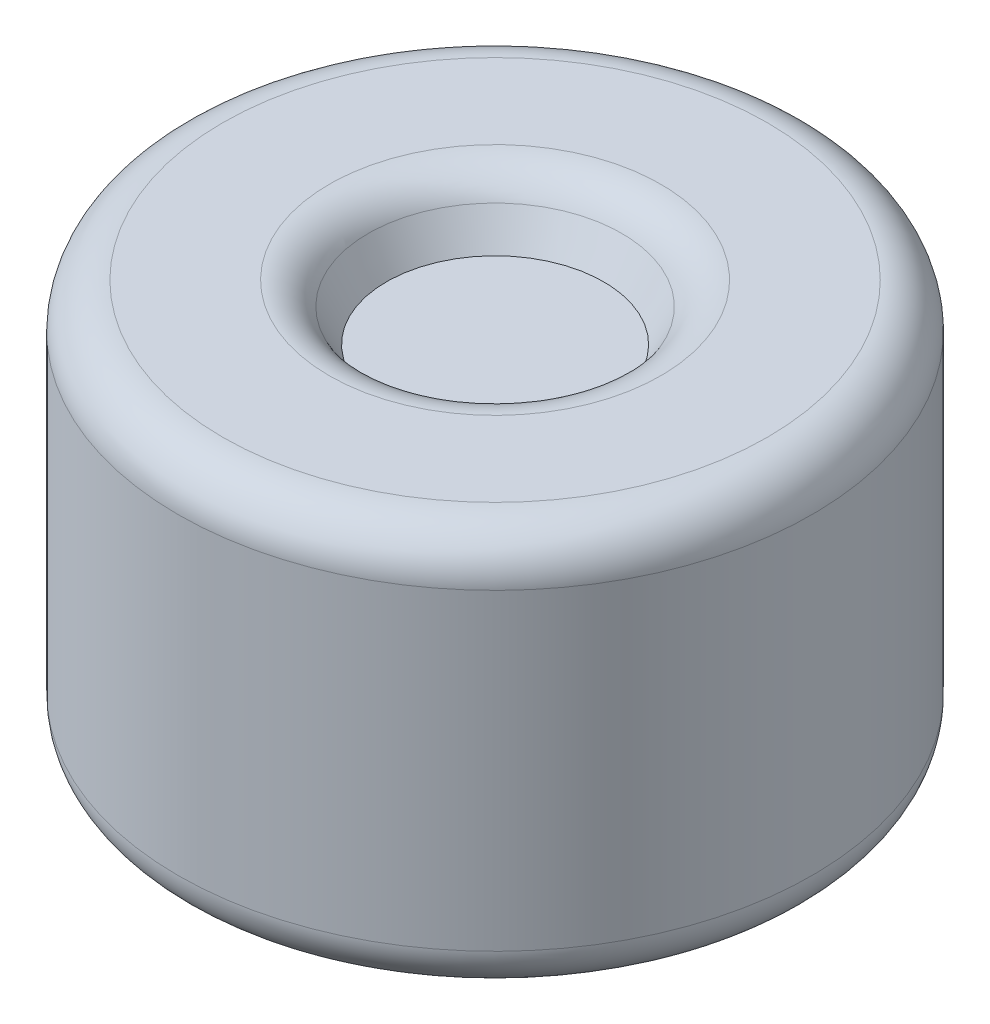
ISO-10303-21;
HEADER;
FILE_DESCRIPTION(('STEP AP214'),'2;1');
FILE_NAME('part.step','',(''),(''),'','','');
FILE_SCHEMA(('AUTOMOTIVE_DESIGN { 1 0 10303 214 1 1 1 1 }'));
ENDSEC;
DATA;
#1=APPLICATION_CONTEXT('core data for automotive mechanical design processes');
#2=APPLICATION_PROTOCOL_DEFINITION('international standard','automotive_design',2000,#1);
#3=PRODUCT_CONTEXT('',#1,'mechanical');
#4=PRODUCT('Part','Part','',(#3));
#5=PRODUCT_RELATED_PRODUCT_CATEGORY('part','',(#4));
#6=PRODUCT_DEFINITION_FORMATION('','',#4);
#7=PRODUCT_DEFINITION_CONTEXT('part definition',#1,'design');
#8=PRODUCT_DEFINITION('design','',#6,#7);
#9=PRODUCT_DEFINITION_SHAPE('','',#8);
#10=(LENGTH_UNIT() NAMED_UNIT(*) SI_UNIT(.MILLI.,.METRE.));
#11=(NAMED_UNIT(*) PLANE_ANGLE_UNIT() SI_UNIT($,.RADIAN.));
#12=(NAMED_UNIT(*) SI_UNIT($,.STERADIAN.) SOLID_ANGLE_UNIT());
#13=UNCERTAINTY_MEASURE_WITH_UNIT(LENGTH_MEASURE(1.E-05),#10,'distance_accuracy_value','');
#14=(GEOMETRIC_REPRESENTATION_CONTEXT(3) GLOBAL_UNCERTAINTY_ASSIGNED_CONTEXT((#13)) GLOBAL_UNIT_ASSIGNED_CONTEXT((#10,
#11,#12)) REPRESENTATION_CONTEXT('',''));
#15=CARTESIAN_POINT('',(0.,0.,0.));
#16=DIRECTION('',(0.,0.,1.));
#17=DIRECTION('',(1.,0.,0.));
#18=AXIS2_PLACEMENT_3D('',#15,#16,#17);
#19=CARTESIAN_POINT('',(0.,180.,0.));
#20=DIRECTION('',(0.,-1.,0.));
#21=DIRECTION('',(0.,0.,-1.));
#22=AXIS2_PLACEMENT_3D('',#19,#20,#21);
#23=CYLINDRICAL_SURFACE('',#22,284.);
#24=CARTESIAN_POINT('',(0.,-140.,0.));
#25=DIRECTION('',(0.,1.,0.));
#26=DIRECTION('',(0.,0.,1.));
#27=AXIS2_PLACEMENT_3D('',#24,#25,#26);
#28=CIRCLE('',#27,284.);
#29=CARTESIAN_POINT('',(0.,-140.,284.));
#30=VERTEX_POINT('',#29);
#31=EDGE_CURVE('E44',#30,#30,#28,.T.);
#32=ORIENTED_EDGE('',*,*,#31,.T.);
#33=EDGE_LOOP('',(#32));
#34=FACE_BOUND('',#33,.T.);
#35=CARTESIAN_POINT('',(0.,140.,0.));
#36=DIRECTION('',(0.,1.,0.));
#37=DIRECTION('',(0.,0.,1.));
#38=AXIS2_PLACEMENT_3D('',#35,#36,#37);
#39=CIRCLE('',#38,284.);
#40=CARTESIAN_POINT('',(0.,140.,284.));
#41=VERTEX_POINT('',#40);
#42=EDGE_CURVE('E57',#41,#41,#39,.F.);
#43=ORIENTED_EDGE('',*,*,#42,.T.);
#44=EDGE_LOOP('',(#43));
#45=FACE_BOUND('',#44,.T.);
#46=ADVANCED_FACE('F37',(#34,#45),#23,.T.);
#47=CARTESIAN_POINT('',(0.,180.,0.));
#48=DIRECTION('',(0.,1.,0.));
#49=DIRECTION('',(0.,0.,1.));
#50=AXIS2_PLACEMENT_3D('',#47,#48,#49);
#51=PLANE('',#50);
#52=CARTESIAN_POINT('',(0.,180.,0.));
#53=DIRECTION('',(0.,1.,0.));
#54=DIRECTION('',(0.,0.,1.));
#55=AXIS2_PLACEMENT_3D('',#52,#53,#54);
#56=CIRCLE('',#55,148.561800656822);
#57=CARTESIAN_POINT('',(0.,180.,148.561800656822));
#58=VERTEX_POINT('',#57);
#59=EDGE_CURVE('E48',#58,#58,#56,.F.);
#60=ORIENTED_EDGE('',*,*,#59,.T.);
#61=EDGE_LOOP('',(#60));
#62=FACE_BOUND('',#61,.T.);
#63=CARTESIAN_POINT('',(0.,180.,0.));
#64=DIRECTION('',(0.,1.,0.));
#65=DIRECTION('',(0.,0.,1.));
#66=AXIS2_PLACEMENT_3D('',#63,#64,#65);
#67=CIRCLE('',#66,244.);
#68=CARTESIAN_POINT('',(0.,180.,244.));
#69=VERTEX_POINT('',#68);
#70=EDGE_CURVE('E60',#69,#69,#67,.T.);
#71=ORIENTED_EDGE('',*,*,#70,.T.);
#72=EDGE_LOOP('',(#71));
#73=FACE_BOUND('',#72,.T.);
#74=ADVANCED_FACE('F80',(#62,#73),#51,.T.);
#75=CARTESIAN_POINT('',(0.,-180.,0.));
#76=DIRECTION('',(0.,1.,0.));
#77=DIRECTION('',(0.,0.,1.));
#78=AXIS2_PLACEMENT_3D('',#75,#76,#77);
#79=PLANE('',#78);
#80=CARTESIAN_POINT('',(0.,-180.,0.));
#81=DIRECTION('',(0.,1.,0.));
#82=DIRECTION('',(0.,0.,1.));
#83=AXIS2_PLACEMENT_3D('',#80,#81,#82);
#84=CIRCLE('',#83,244.);
#85=CARTESIAN_POINT('',(0.,-180.,244.));
#86=VERTEX_POINT('',#85);
#87=EDGE_CURVE('E10',#86,#86,#84,.F.);
#88=ORIENTED_EDGE('',*,*,#87,.T.);
#89=EDGE_LOOP('',(#88));
#90=FACE_BOUND('',#89,.T.);
#91=ADVANCED_FACE('F71',(#90),#79,.F.);
#92=CARTESIAN_POINT('',(0.,180.,0.));
#93=DIRECTION('',(0.,1.,0.));
#94=DIRECTION('',(0.,0.,1.));
#95=AXIS2_PLACEMENT_3D('',#92,#93,#94);
#96=CONICAL_SURFACE('',#95,125.,0.506145483078356);
#97=CARTESIAN_POINT('',(0.,159.392384809853,0.));
#98=DIRECTION('',(0.,1.,0.));
#99=DIRECTION('',(0.,0.,1.));
#100=AXIS2_PLACEMENT_3D('',#97,#98,#99);
#101=CIRCLE('',#100,113.577012371246);
#102=CARTESIAN_POINT('',(0.,159.392384809853,113.577012371246));
#103=VERTEX_POINT('',#102);
#104=EDGE_CURVE('E52',#103,#103,#101,.T.);
#105=ORIENTED_EDGE('',*,*,#104,.T.);
#106=EDGE_LOOP('',(#105));
#107=FACE_BOUND('',#106,.T.);
#108=CARTESIAN_POINT('',(0.,130.,0.));
#109=DIRECTION('',(0.,1.,0.));
#110=DIRECTION('',(0.,0.,1.));
#111=AXIS2_PLACEMENT_3D('',#108,#109,#110);
#112=CIRCLE('',#111,97.2845474273615);
#113=CARTESIAN_POINT('',(0.,130.,97.2845474273615));
#114=VERTEX_POINT('',#113);
#115=EDGE_CURVE('E63',#114,#114,#112,.T.);
#116=ORIENTED_EDGE('',*,*,#115,.F.);
#117=EDGE_LOOP('',(#116));
#118=FACE_BOUND('',#117,.T.);
#119=ADVANCED_FACE('F69',(#107,#118),#96,.F.);
#120=CARTESIAN_POINT('',(0.,130.,0.));
#121=DIRECTION('',(0.,1.,0.));
#122=DIRECTION('',(0.,0.,1.));
#123=AXIS2_PLACEMENT_3D('',#120,#121,#122);
#124=PLANE('',#123);
#125=ORIENTED_EDGE('',*,*,#115,.T.);
#126=EDGE_LOOP('',(#125));
#127=FACE_BOUND('',#126,.T.);
#128=ADVANCED_FACE('F67',(#127),#124,.T.);
#129=CARTESIAN_POINT('',(0.,140.,0.));
#130=DIRECTION('',(0.,1.,0.));
#131=DIRECTION('',(0.,0.,1.));
#132=AXIS2_PLACEMENT_3D('',#129,#130,#131);
#133=TOROIDAL_SURFACE('',#132,244.,40.);
#134=ORIENTED_EDGE('',*,*,#42,.F.);
#135=EDGE_LOOP('',(#134));
#136=FACE_BOUND('',#135,.T.);
#137=ORIENTED_EDGE('',*,*,#70,.F.);
#138=EDGE_LOOP('',(#137));
#139=FACE_BOUND('',#138,.T.);
#140=ADVANCED_FACE('F78',(#136,#139),#133,.T.);
#141=CARTESIAN_POINT('',(0.,140.,0.));
#142=DIRECTION('',(0.,1.,0.));
#143=DIRECTION('',(0.,0.,1.));
#144=AXIS2_PLACEMENT_3D('',#141,#142,#143);
#145=TOROIDAL_SURFACE('',#144,148.561800656822,40.);
#146=ORIENTED_EDGE('',*,*,#59,.F.);
#147=EDGE_LOOP('',(#146));
#148=FACE_BOUND('',#147,.T.);
#149=ORIENTED_EDGE('',*,*,#104,.F.);
#150=EDGE_LOOP('',(#149));
#151=FACE_BOUND('',#150,.T.);
#152=ADVANCED_FACE('F92',(#148,#151),#145,.T.);
#153=CARTESIAN_POINT('',(0.,-140.,0.));
#154=DIRECTION('',(0.,1.,0.));
#155=DIRECTION('',(0.,0.,1.));
#156=AXIS2_PLACEMENT_3D('',#153,#154,#155);
#157=TOROIDAL_SURFACE('',#156,244.,40.);
#158=ORIENTED_EDGE('',*,*,#87,.F.);
#159=EDGE_LOOP('',(#158));
#160=FACE_BOUND('',#159,.T.);
#161=ORIENTED_EDGE('',*,*,#31,.F.);
#162=EDGE_LOOP('',(#161));
#163=FACE_BOUND('',#162,.T.);
#164=ADVANCED_FACE('F39',(#160,#163),#157,.T.);
#165=CLOSED_SHELL('',(#46,#74,#91,#119,#128,#140,#152,#164));
#166=MANIFOLD_SOLID_BREP('B2',#165);
#167=ADVANCED_BREP_SHAPE_REPRESENTATION('',(#18,#166),#14);
#168=SHAPE_DEFINITION_REPRESENTATION(#9,#167);
ENDSEC;
END-ISO-10303-21;
